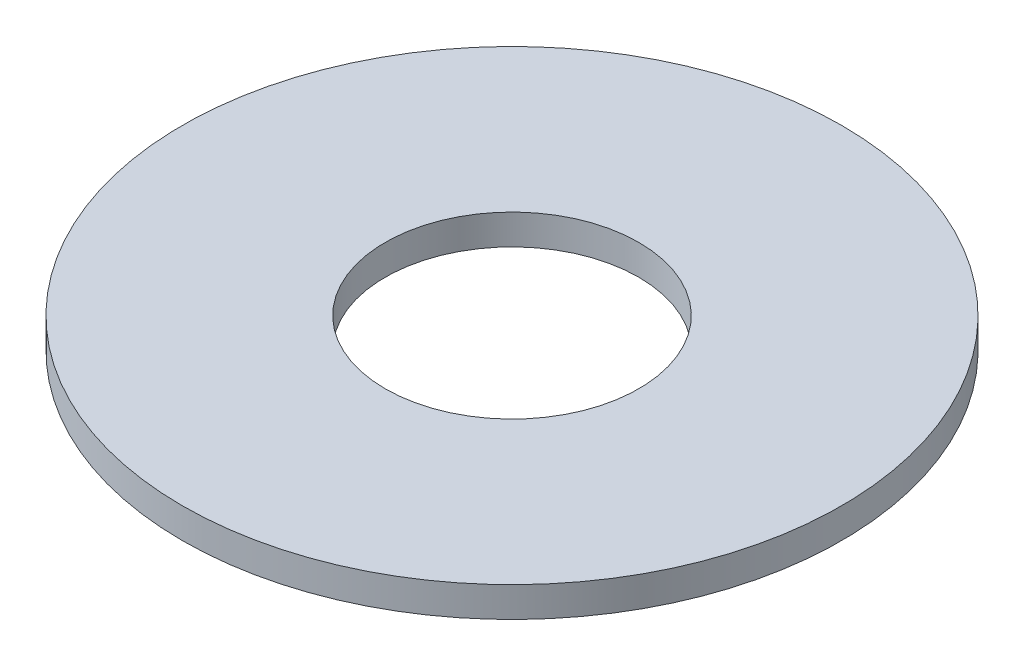
ISO-10303-21;
HEADER;
FILE_DESCRIPTION(('STEP AP214'),'2;1');
FILE_NAME('part.step','',(''),(''),'','','');
FILE_SCHEMA(('AUTOMOTIVE_DESIGN { 1 0 10303 214 1 1 1 1 }'));
ENDSEC;
DATA;
#1=APPLICATION_CONTEXT('core data for automotive mechanical design processes');
#2=APPLICATION_PROTOCOL_DEFINITION('international standard','automotive_design',2000,#1);
#3=PRODUCT_CONTEXT('',#1,'mechanical');
#4=PRODUCT('Part','Part','',(#3));
#5=PRODUCT_RELATED_PRODUCT_CATEGORY('part','',(#4));
#6=PRODUCT_DEFINITION_FORMATION('','',#4);
#7=PRODUCT_DEFINITION_CONTEXT('part definition',#1,'design');
#8=PRODUCT_DEFINITION('design','',#6,#7);
#9=PRODUCT_DEFINITION_SHAPE('','',#8);
#10=(LENGTH_UNIT() NAMED_UNIT(*) SI_UNIT(.MILLI.,.METRE.));
#11=(NAMED_UNIT(*) PLANE_ANGLE_UNIT() SI_UNIT($,.RADIAN.));
#12=(NAMED_UNIT(*) SI_UNIT($,.STERADIAN.) SOLID_ANGLE_UNIT());
#13=UNCERTAINTY_MEASURE_WITH_UNIT(LENGTH_MEASURE(1.E-05),#10,'distance_accuracy_value','');
#14=(GEOMETRIC_REPRESENTATION_CONTEXT(3) GLOBAL_UNCERTAINTY_ASSIGNED_CONTEXT((#13)) GLOBAL_UNIT_ASSIGNED_CONTEXT((#10,
#11,#12)) REPRESENTATION_CONTEXT('',''));
#15=CARTESIAN_POINT('',(0.,0.,0.));
#16=DIRECTION('',(0.,0.,1.));
#17=DIRECTION('',(1.,0.,0.));
#18=AXIS2_PLACEMENT_3D('',#15,#16,#17);
#19=CARTESIAN_POINT('',(0.,3.175,0.));
#20=DIRECTION('',(0.,1.,0.));
#21=DIRECTION('',(0.,0.,1.));
#22=AXIS2_PLACEMENT_3D('',#19,#20,#21);
#23=PLANE('',#22);
#24=CARTESIAN_POINT('',(0.,3.175,0.));
#25=DIRECTION('',(0.,1.,0.));
#26=DIRECTION('',(0.,0.,1.));
#27=AXIS2_PLACEMENT_3D('',#24,#25,#26);
#28=CIRCLE('',#27,34.6583);
#29=CARTESIAN_POINT('',(0.,3.175,34.6583));
#30=VERTEX_POINT('',#29);
#31=EDGE_CURVE('E10',#30,#30,#28,.T.);
#32=ORIENTED_EDGE('',*,*,#31,.T.);
#33=EDGE_LOOP('',(#32));
#34=FACE_BOUND('',#33,.T.);
#35=CARTESIAN_POINT('',(0.,3.175,0.));
#36=DIRECTION('',(0.,1.,0.));
#37=DIRECTION('',(0.,0.,1.));
#38=AXIS2_PLACEMENT_3D('',#35,#36,#37);
#39=CIRCLE('',#38,13.335);
#40=CARTESIAN_POINT('',(0.,3.175,13.335));
#41=VERTEX_POINT('',#40);
#42=EDGE_CURVE('E42',#41,#41,#39,.T.);
#43=ORIENTED_EDGE('',*,*,#42,.F.);
#44=EDGE_LOOP('',(#43));
#45=FACE_BOUND('',#44,.T.);
#46=ADVANCED_FACE('F31',(#34,#45),#23,.T.);
#47=CARTESIAN_POINT('',(0.,0.,0.));
#48=DIRECTION('',(0.,1.,0.));
#49=DIRECTION('',(0.,0.,1.));
#50=AXIS2_PLACEMENT_3D('',#47,#48,#49);
#51=PLANE('',#50);
#52=CARTESIAN_POINT('',(0.,0.,0.));
#53=DIRECTION('',(0.,1.,0.));
#54=DIRECTION('',(0.,0.,1.));
#55=AXIS2_PLACEMENT_3D('',#52,#53,#54);
#56=CIRCLE('',#55,34.6583);
#57=CARTESIAN_POINT('',(0.,0.,34.6583));
#58=VERTEX_POINT('',#57);
#59=EDGE_CURVE('E35',#58,#58,#56,.T.);
#60=ORIENTED_EDGE('',*,*,#59,.F.);
#61=EDGE_LOOP('',(#60));
#62=FACE_BOUND('',#61,.T.);
#63=CARTESIAN_POINT('',(0.,0.,0.));
#64=DIRECTION('',(0.,1.,0.));
#65=DIRECTION('',(0.,0.,1.));
#66=AXIS2_PLACEMENT_3D('',#63,#64,#65);
#67=CIRCLE('',#66,13.335);
#68=CARTESIAN_POINT('',(0.,0.,13.335));
#69=VERTEX_POINT('',#68);
#70=EDGE_CURVE('E44',#69,#69,#67,.T.);
#71=ORIENTED_EDGE('',*,*,#70,.T.);
#72=EDGE_LOOP('',(#71));
#73=FACE_BOUND('',#72,.T.);
#74=ADVANCED_FACE('F54',(#62,#73),#51,.F.);
#75=CARTESIAN_POINT('',(0.,3.175,0.));
#76=DIRECTION('',(0.,-1.,0.));
#77=DIRECTION('',(0.,0.,-1.));
#78=AXIS2_PLACEMENT_3D('',#75,#76,#77);
#79=CYLINDRICAL_SURFACE('',#78,34.6583);
#80=ORIENTED_EDGE('',*,*,#31,.F.);
#81=EDGE_LOOP('',(#80));
#82=FACE_BOUND('',#81,.T.);
#83=ORIENTED_EDGE('',*,*,#59,.T.);
#84=EDGE_LOOP('',(#83));
#85=FACE_BOUND('',#84,.T.);
#86=ADVANCED_FACE('F33',(#82,#85),#79,.T.);
#87=CARTESIAN_POINT('',(0.,3.175,0.));
#88=DIRECTION('',(0.,-1.,0.));
#89=DIRECTION('',(0.,0.,-1.));
#90=AXIS2_PLACEMENT_3D('',#87,#88,#89);
#91=CYLINDRICAL_SURFACE('',#90,13.335);
#92=ORIENTED_EDGE('',*,*,#42,.T.);
#93=EDGE_LOOP('',(#92));
#94=FACE_BOUND('',#93,.T.);
#95=ORIENTED_EDGE('',*,*,#70,.F.);
#96=EDGE_LOOP('',(#95));
#97=FACE_BOUND('',#96,.T.);
#98=ADVANCED_FACE('F50',(#94,#97),#91,.F.);
#99=CLOSED_SHELL('',(#46,#74,#86,#98));
#100=MANIFOLD_SOLID_BREP('B2',#99);
#101=ADVANCED_BREP_SHAPE_REPRESENTATION('',(#18,#100),#14);
#102=SHAPE_DEFINITION_REPRESENTATION(#9,#101);
ENDSEC;
END-ISO-10303-21;
